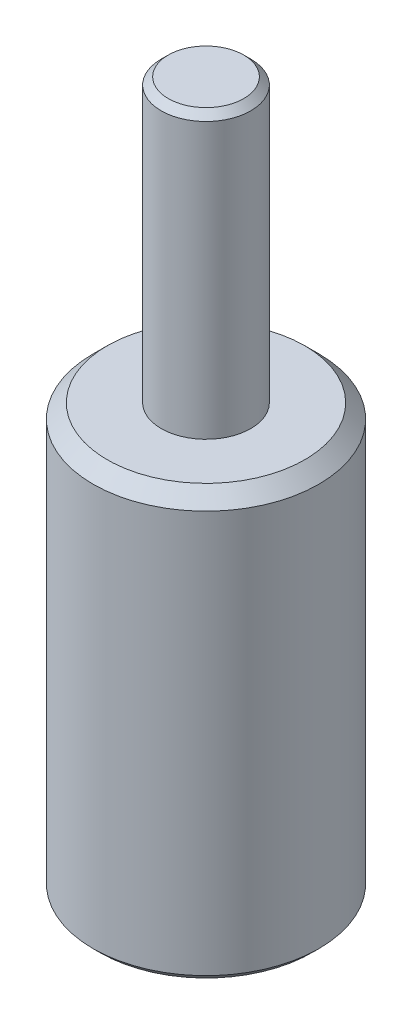
ISO-10303-21;
HEADER;
FILE_DESCRIPTION(('STEP AP214'),'2;1');
FILE_NAME('part.step','',(''),(''),'','','');
FILE_SCHEMA(('AUTOMOTIVE_DESIGN { 1 0 10303 214 1 1 1 1 }'));
ENDSEC;
DATA;
#1=APPLICATION_CONTEXT('core data for automotive mechanical design processes');
#2=APPLICATION_PROTOCOL_DEFINITION('international standard','automotive_design',2000,#1);
#3=PRODUCT_CONTEXT('',#1,'mechanical');
#4=PRODUCT('Part','Part','',(#3));
#5=PRODUCT_RELATED_PRODUCT_CATEGORY('part','',(#4));
#6=PRODUCT_DEFINITION_FORMATION('','',#4);
#7=PRODUCT_DEFINITION_CONTEXT('part definition',#1,'design');
#8=PRODUCT_DEFINITION('design','',#6,#7);
#9=PRODUCT_DEFINITION_SHAPE('','',#8);
#10=(LENGTH_UNIT() NAMED_UNIT(*) SI_UNIT(.MILLI.,.METRE.));
#11=(NAMED_UNIT(*) PLANE_ANGLE_UNIT() SI_UNIT($,.RADIAN.));
#12=(NAMED_UNIT(*) SI_UNIT($,.STERADIAN.) SOLID_ANGLE_UNIT());
#13=UNCERTAINTY_MEASURE_WITH_UNIT(LENGTH_MEASURE(1.E-05),#10,'distance_accuracy_value','');
#14=(GEOMETRIC_REPRESENTATION_CONTEXT(3) GLOBAL_UNCERTAINTY_ASSIGNED_CONTEXT((#13)) GLOBAL_UNIT_ASSIGNED_CONTEXT((#10,
#11,#12)) REPRESENTATION_CONTEXT('',''));
#15=CARTESIAN_POINT('',(0.,0.,0.));
#16=DIRECTION('',(0.,0.,1.));
#17=DIRECTION('',(1.,0.,0.));
#18=AXIS2_PLACEMENT_3D('',#15,#16,#17);
#19=CARTESIAN_POINT('',(0.,50.,0.));
#20=DIRECTION('',(0.,1.,0.));
#21=DIRECTION('',(0.,0.,1.));
#22=AXIS2_PLACEMENT_3D('',#19,#20,#21);
#23=CYLINDRICAL_SURFACE('',#22,8.);
#24=CARTESIAN_POINT('',(0.,0.499999999999994,0.));
#25=DIRECTION('',(0.,1.,0.));
#26=DIRECTION('',(0.,0.,1.));
#27=AXIS2_PLACEMENT_3D('',#24,#25,#26);
#28=CIRCLE('',#27,8.);
#29=CARTESIAN_POINT('',(0.,0.499999999999994,8.));
#30=VERTEX_POINT('',#29);
#31=EDGE_CURVE('E66',#30,#30,#28,.T.);
#32=ORIENTED_EDGE('',*,*,#31,.T.);
#33=EDGE_LOOP('',(#32));
#34=FACE_BOUND('',#33,.T.);
#35=CARTESIAN_POINT('',(0.,29.,0.));
#36=DIRECTION('',(0.,-1.,0.));
#37=DIRECTION('',(0.,0.,-1.));
#38=AXIS2_PLACEMENT_3D('',#35,#36,#37);
#39=CIRCLE('',#38,8.);
#40=CARTESIAN_POINT('',(0.,29.,-8.));
#41=VERTEX_POINT('',#40);
#42=EDGE_CURVE('E63',#41,#41,#39,.T.);
#43=ORIENTED_EDGE('',*,*,#42,.T.);
#44=EDGE_LOOP('',(#43));
#45=FACE_BOUND('',#44,.T.);
#46=ADVANCED_FACE('F33',(#34,#45),#23,.T.);
#47=CARTESIAN_POINT('',(8.,30.,0.));
#48=DIRECTION('',(0.,-1.,0.));
#49=DIRECTION('',(0.,0.,-1.));
#50=AXIS2_PLACEMENT_3D('',#47,#48,#49);
#51=PLANE('',#50);
#52=CARTESIAN_POINT('',(0.,30.,0.));
#53=DIRECTION('',(0.,-1.,0.));
#54=DIRECTION('',(0.,0.,-1.));
#55=AXIS2_PLACEMENT_3D('',#52,#53,#54);
#56=CIRCLE('',#55,7.00000000000002);
#57=CARTESIAN_POINT('',(0.,30.,-7.00000000000002));
#58=VERTEX_POINT('',#57);
#59=EDGE_CURVE('E56',#58,#58,#56,.F.);
#60=ORIENTED_EDGE('',*,*,#59,.T.);
#61=EDGE_LOOP('',(#60));
#62=FACE_BOUND('',#61,.T.);
#63=CARTESIAN_POINT('',(0.,30.,0.));
#64=DIRECTION('',(0.,1.,0.));
#65=DIRECTION('',(0.,0.,1.));
#66=AXIS2_PLACEMENT_3D('',#63,#64,#65);
#67=CIRCLE('',#66,3.17500000000001);
#68=CARTESIAN_POINT('',(0.,30.,3.17500000000001));
#69=VERTEX_POINT('',#68);
#70=EDGE_CURVE('E52',#69,#69,#67,.T.);
#71=ORIENTED_EDGE('',*,*,#70,.F.);
#72=EDGE_LOOP('',(#71));
#73=FACE_BOUND('',#72,.T.);
#74=ADVANCED_FACE('F86',(#62,#73),#51,.F.);
#75=CARTESIAN_POINT('',(0.,50.,0.));
#76=DIRECTION('',(0.,1.,0.));
#77=DIRECTION('',(0.,0.,1.));
#78=AXIS2_PLACEMENT_3D('',#75,#76,#77);
#79=CYLINDRICAL_SURFACE('',#78,3.17500000000001);
#80=CARTESIAN_POINT('',(0.,49.5,0.));
#81=DIRECTION('',(0.,-1.,0.));
#82=DIRECTION('',(0.,0.,-1.));
#83=AXIS2_PLACEMENT_3D('',#80,#81,#82);
#84=CIRCLE('',#83,3.17500000000001);
#85=CARTESIAN_POINT('',(0.,49.5,-3.17500000000001));
#86=VERTEX_POINT('',#85);
#87=EDGE_CURVE('E11',#86,#86,#84,.T.);
#88=ORIENTED_EDGE('',*,*,#87,.T.);
#89=EDGE_LOOP('',(#88));
#90=FACE_BOUND('',#89,.T.);
#91=ORIENTED_EDGE('',*,*,#70,.T.);
#92=EDGE_LOOP('',(#91));
#93=FACE_BOUND('',#92,.T.);
#94=ADVANCED_FACE('F92',(#90,#93),#79,.T.);
#95=CARTESIAN_POINT('',(3.17500000000001,50.,0.));
#96=DIRECTION('',(0.,-1.,0.));
#97=DIRECTION('',(0.,0.,-1.));
#98=AXIS2_PLACEMENT_3D('',#95,#96,#97);
#99=PLANE('',#98);
#100=CARTESIAN_POINT('',(0.,50.,0.));
#101=DIRECTION('',(0.,-1.,0.));
#102=DIRECTION('',(0.,0.,-1.));
#103=AXIS2_PLACEMENT_3D('',#100,#101,#102);
#104=CIRCLE('',#103,2.675);
#105=CARTESIAN_POINT('',(0.,50.,-2.675));
#106=VERTEX_POINT('',#105);
#107=EDGE_CURVE('E40',#106,#106,#104,.F.);
#108=ORIENTED_EDGE('',*,*,#107,.T.);
#109=EDGE_LOOP('',(#108));
#110=FACE_BOUND('',#109,.T.);
#111=ADVANCED_FACE('F74',(#110),#99,.F.);
#112=CARTESIAN_POINT('',(0.,0.,0.));
#113=DIRECTION('',(0.,1.,0.));
#114=DIRECTION('',(0.,0.,1.));
#115=AXIS2_PLACEMENT_3D('',#112,#113,#114);
#116=PLANE('',#115);
#117=CARTESIAN_POINT('',(0.,0.,0.));
#118=DIRECTION('',(0.,-1.,0.));
#119=DIRECTION('',(0.,0.,-1.));
#120=AXIS2_PLACEMENT_3D('',#117,#118,#119);
#121=CIRCLE('',#120,3.175);
#122=CARTESIAN_POINT('',(0.,0.,-3.175));
#123=VERTEX_POINT('',#122);
#124=EDGE_CURVE('E53',#123,#123,#121,.T.);
#125=ORIENTED_EDGE('',*,*,#124,.F.);
#126=EDGE_LOOP('',(#125));
#127=FACE_BOUND('',#126,.T.);
#128=CARTESIAN_POINT('',(0.,0.,0.));
#129=DIRECTION('',(0.,1.,0.));
#130=DIRECTION('',(0.,0.,1.));
#131=AXIS2_PLACEMENT_3D('',#128,#129,#130);
#132=CIRCLE('',#131,7.50000000000001);
#133=CARTESIAN_POINT('',(0.,0.,7.50000000000001));
#134=VERTEX_POINT('',#133);
#135=EDGE_CURVE('E69',#134,#134,#132,.F.);
#136=ORIENTED_EDGE('',*,*,#135,.T.);
#137=EDGE_LOOP('',(#136));
#138=FACE_BOUND('',#137,.T.);
#139=ADVANCED_FACE('F99',(#127,#138),#116,.F.);
#140=CARTESIAN_POINT('',(0.,30.,0.));
#141=DIRECTION('',(0.,-1.,0.));
#142=DIRECTION('',(0.,0.,-1.));
#143=AXIS2_PLACEMENT_3D('',#140,#141,#142);
#144=CONICAL_SURFACE('',#143,7.00000000000002,0.785398163397445);
#145=ORIENTED_EDGE('',*,*,#42,.F.);
#146=EDGE_LOOP('',(#145));
#147=FACE_BOUND('',#146,.T.);
#148=ORIENTED_EDGE('',*,*,#59,.F.);
#149=EDGE_LOOP('',(#148));
#150=FACE_BOUND('',#149,.T.);
#151=ADVANCED_FACE('F82',(#147,#150),#144,.T.);
#152=CARTESIAN_POINT('',(0.,0.499999999999994,0.));
#153=DIRECTION('',(0.,1.,0.));
#154=DIRECTION('',(0.,0.,1.));
#155=AXIS2_PLACEMENT_3D('',#152,#153,#154);
#156=CONICAL_SURFACE('',#155,8.,0.785398163397448);
#157=ORIENTED_EDGE('',*,*,#135,.F.);
#158=EDGE_LOOP('',(#157));
#159=FACE_BOUND('',#158,.T.);
#160=ORIENTED_EDGE('',*,*,#31,.F.);
#161=EDGE_LOOP('',(#160));
#162=FACE_BOUND('',#161,.T.);
#163=ADVANCED_FACE('F77',(#159,#162),#156,.T.);
#164=CARTESIAN_POINT('',(0.,50.,0.));
#165=DIRECTION('',(0.,-1.,0.));
#166=DIRECTION('',(0.,0.,-1.));
#167=AXIS2_PLACEMENT_3D('',#164,#165,#166);
#168=CONICAL_SURFACE('',#167,2.675,0.785398163397452);
#169=ORIENTED_EDGE('',*,*,#87,.F.);
#170=EDGE_LOOP('',(#169));
#171=FACE_BOUND('',#170,.T.);
#172=ORIENTED_EDGE('',*,*,#107,.F.);
#173=EDGE_LOOP('',(#172));
#174=FACE_BOUND('',#173,.T.);
#175=ADVANCED_FACE('F35',(#171,#174),#168,.T.);
#176=CARTESIAN_POINT('',(0.,20.,0.));
#177=DIRECTION('',(0.,-1.,0.));
#178=DIRECTION('',(0.,0.,-1.));
#179=AXIS2_PLACEMENT_3D('',#176,#177,#178);
#180=CONICAL_SURFACE('',#179,3.175,1.02974425867665);
#181=CARTESIAN_POINT('',(0.,21.9077324654125,0.));
#182=VERTEX_POINT('',#181);
#183=VERTEX_LOOP('',#182);
#184=FACE_BOUND('',#183,.T.);
#185=CARTESIAN_POINT('',(0.,20.,0.));
#186=DIRECTION('',(0.,-1.,0.));
#187=DIRECTION('',(0.,0.,-1.));
#188=AXIS2_PLACEMENT_3D('',#185,#186,#187);
#189=CIRCLE('',#188,3.175);
#190=CARTESIAN_POINT('',(0.,20.,-3.175));
#191=VERTEX_POINT('',#190);
#192=EDGE_CURVE('E50',#191,#191,#189,.T.);
#193=ORIENTED_EDGE('',*,*,#192,.T.);
#194=EDGE_LOOP('',(#193));
#195=FACE_BOUND('',#194,.T.);
#196=ADVANCED_FACE('F43',(#184,#195),#180,.F.);
#197=CARTESIAN_POINT('',(0.,0.,0.));
#198=DIRECTION('',(0.,-1.,0.));
#199=DIRECTION('',(0.,0.,-1.));
#200=AXIS2_PLACEMENT_3D('',#197,#198,#199);
#201=CYLINDRICAL_SURFACE('',#200,3.175);
#202=ORIENTED_EDGE('',*,*,#192,.F.);
#203=EDGE_LOOP('',(#202));
#204=FACE_BOUND('',#203,.T.);
#205=ORIENTED_EDGE('',*,*,#124,.T.);
#206=EDGE_LOOP('',(#205));
#207=FACE_BOUND('',#206,.T.);
#208=ADVANCED_FACE('F46',(#204,#207),#201,.F.);
#209=CLOSED_SHELL('',(#46,#74,#94,#111,#139,#151,#163,#175,#196,#208));
#210=MANIFOLD_SOLID_BREP('B2',#209);
#211=ADVANCED_BREP_SHAPE_REPRESENTATION('',(#18,#210),#14);
#212=SHAPE_DEFINITION_REPRESENTATION(#9,#211);
ENDSEC;
END-ISO-10303-21;
